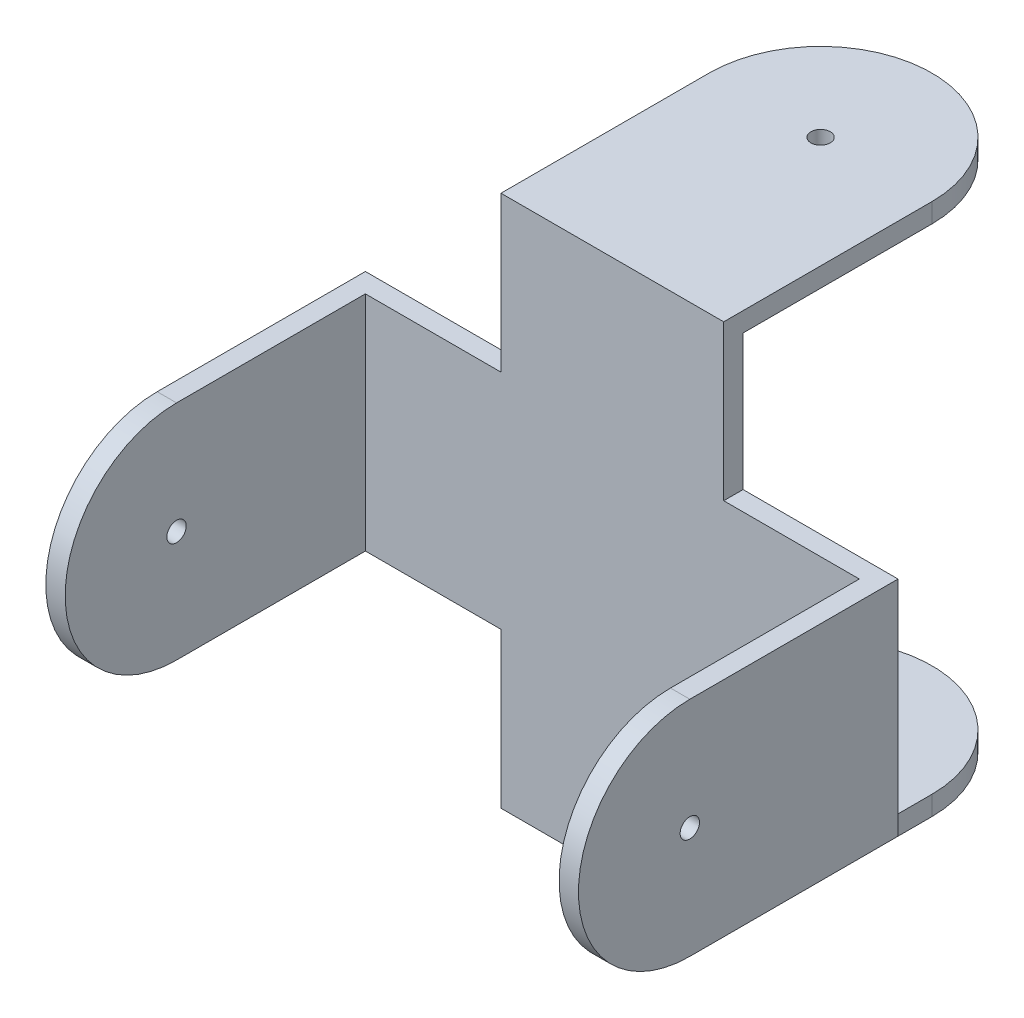
ISO-10303-21;
HEADER;
FILE_DESCRIPTION(('STEP AP214'),'2;1');
FILE_NAME('part.step','',(''),(''),'','','');
FILE_SCHEMA(('AUTOMOTIVE_DESIGN { 1 0 10303 214 1 1 1 1 }'));
ENDSEC;
DATA;
#1=APPLICATION_CONTEXT('core data for automotive mechanical design processes');
#2=APPLICATION_PROTOCOL_DEFINITION('international standard','automotive_design',2000,#1);
#3=PRODUCT_CONTEXT('',#1,'mechanical');
#4=PRODUCT('Part','Part','',(#3));
#5=PRODUCT_RELATED_PRODUCT_CATEGORY('part','',(#4));
#6=PRODUCT_DEFINITION_FORMATION('','',#4);
#7=PRODUCT_DEFINITION_CONTEXT('part definition',#1,'design');
#8=PRODUCT_DEFINITION('design','',#6,#7);
#9=PRODUCT_DEFINITION_SHAPE('','',#8);
#10=(LENGTH_UNIT() NAMED_UNIT(*) SI_UNIT(.MILLI.,.METRE.));
#11=(NAMED_UNIT(*) PLANE_ANGLE_UNIT() SI_UNIT($,.RADIAN.));
#12=(NAMED_UNIT(*) SI_UNIT($,.STERADIAN.) SOLID_ANGLE_UNIT());
#13=UNCERTAINTY_MEASURE_WITH_UNIT(LENGTH_MEASURE(1.E-05),#10,'distance_accuracy_value','');
#14=(GEOMETRIC_REPRESENTATION_CONTEXT(3) GLOBAL_UNCERTAINTY_ASSIGNED_CONTEXT((#13)) GLOBAL_UNIT_ASSIGNED_CONTEXT((#10,
#11,#12)) REPRESENTATION_CONTEXT('',''));
#15=CARTESIAN_POINT('',(0.,0.,0.));
#16=DIRECTION('',(0.,0.,1.));
#17=DIRECTION('',(1.,0.,0.));
#18=AXIS2_PLACEMENT_3D('',#15,#16,#17);
#19=CARTESIAN_POINT('',(0.,0.,2.));
#20=DIRECTION('',(0.,0.,-1.));
#21=DIRECTION('',(-1.,0.,0.));
#22=AXIS2_PLACEMENT_3D('',#19,#20,#21);
#23=PLANE('',#22);
#24=DIRECTION('',(0.,-1.,0.));
#25=VECTOR('',#24,1.);
#26=CARTESIAN_POINT('',(25.5000000000002,0.,2.));
#27=LINE('',#26,#25);
#28=CARTESIAN_POINT('',(25.5000000000002,11.5000000000001,2.));
#29=VERTEX_POINT('',#28);
#30=CARTESIAN_POINT('',(25.5000000000002,-11.5,2.));
#31=VERTEX_POINT('',#30);
#32=EDGE_CURVE('E59',#29,#31,#27,.T.);
#33=ORIENTED_EDGE('',*,*,#32,.F.);
#34=DIRECTION('',(-1.,0.,0.));
#35=VECTOR('',#34,1.);
#36=CARTESIAN_POINT('',(27.5000000000002,11.5000000000001,2.));
#37=LINE('',#36,#35);
#38=CARTESIAN_POINT('',(11.5,11.5,2.));
#39=VERTEX_POINT('',#38);
#40=EDGE_CURVE('E200',#29,#39,#37,.T.);
#41=ORIENTED_EDGE('',*,*,#40,.T.);
#42=DIRECTION('',(0.,1.,0.));
#43=VECTOR('',#42,1.);
#44=CARTESIAN_POINT('',(11.5,11.5,2.));
#45=LINE('',#44,#43);
#46=CARTESIAN_POINT('',(11.5,27.5,2.));
#47=VERTEX_POINT('',#46);
#48=EDGE_CURVE('E312',#39,#47,#45,.T.);
#49=ORIENTED_EDGE('',*,*,#48,.T.);
#50=DIRECTION('',(-1.,0.,0.));
#51=VECTOR('',#50,1.);
#52=CARTESIAN_POINT('',(-11.5,27.5,2.));
#53=LINE('',#52,#51);
#54=CARTESIAN_POINT('',(-11.5,27.5,2.));
#55=VERTEX_POINT('',#54);
#56=EDGE_CURVE('E315',#47,#55,#53,.T.);
#57=ORIENTED_EDGE('',*,*,#56,.T.);
#58=DIRECTION('',(0.,-1.,0.));
#59=VECTOR('',#58,1.);
#60=CARTESIAN_POINT('',(-11.5,11.5,2.));
#61=LINE('',#60,#59);
#62=CARTESIAN_POINT('',(-11.5,11.5,2.));
#63=VERTEX_POINT('',#62);
#64=EDGE_CURVE('E319',#55,#63,#61,.T.);
#65=ORIENTED_EDGE('',*,*,#64,.T.);
#66=DIRECTION('',(-1.,0.,0.));
#67=VECTOR('',#66,1.);
#68=CARTESIAN_POINT('',(-11.5,11.5,2.));
#69=LINE('',#68,#67);
#70=CARTESIAN_POINT('',(-25.5000000000002,11.5,2.));
#71=VERTEX_POINT('',#70);
#72=EDGE_CURVE('E322',#63,#71,#69,.T.);
#73=ORIENTED_EDGE('',*,*,#72,.T.);
#74=DIRECTION('',(0.,1.,0.));
#75=VECTOR('',#74,1.);
#76=CARTESIAN_POINT('',(-25.5000000000002,0.,2.));
#77=LINE('',#76,#75);
#78=CARTESIAN_POINT('',(-25.5000000000002,-11.5000000000001,2.));
#79=VERTEX_POINT('',#78);
#80=EDGE_CURVE('E11',#79,#71,#77,.T.);
#81=ORIENTED_EDGE('',*,*,#80,.F.);
#82=DIRECTION('',(1.,0.,0.));
#83=VECTOR('',#82,1.);
#84=CARTESIAN_POINT('',(-11.5,-11.5,2.));
#85=LINE('',#84,#83);
#86=CARTESIAN_POINT('',(-11.5,-11.5,2.));
#87=VERTEX_POINT('',#86);
#88=EDGE_CURVE('E325',#79,#87,#85,.T.);
#89=ORIENTED_EDGE('',*,*,#88,.T.);
#90=DIRECTION('',(0.,-1.,0.));
#91=VECTOR('',#90,1.);
#92=CARTESIAN_POINT('',(-11.5,-27.5,2.));
#93=LINE('',#92,#91);
#94=CARTESIAN_POINT('',(-11.5,-27.5,2.));
#95=VERTEX_POINT('',#94);
#96=EDGE_CURVE('E328',#87,#95,#93,.T.);
#97=ORIENTED_EDGE('',*,*,#96,.T.);
#98=DIRECTION('',(1.,0.,0.));
#99=VECTOR('',#98,1.);
#100=CARTESIAN_POINT('',(-11.5,-27.5,2.));
#101=LINE('',#100,#99);
#102=CARTESIAN_POINT('',(11.5,-27.5,2.));
#103=VERTEX_POINT('',#102);
#104=EDGE_CURVE('E331',#95,#103,#101,.T.);
#105=ORIENTED_EDGE('',*,*,#104,.T.);
#106=DIRECTION('',(0.,1.,0.));
#107=VECTOR('',#106,1.);
#108=CARTESIAN_POINT('',(11.5,-27.5,2.));
#109=LINE('',#108,#107);
#110=CARTESIAN_POINT('',(11.5,-11.5,2.));
#111=VERTEX_POINT('',#110);
#112=EDGE_CURVE('E334',#103,#111,#109,.T.);
#113=ORIENTED_EDGE('',*,*,#112,.T.);
#114=DIRECTION('',(1.,0.,0.));
#115=VECTOR('',#114,1.);
#116=CARTESIAN_POINT('',(27.5000000000002,-11.5000000000001,2.));
#117=LINE('',#116,#115);
#118=EDGE_CURVE('E55',#111,#31,#117,.T.);
#119=ORIENTED_EDGE('',*,*,#118,.T.);
#120=EDGE_LOOP('',(#33,#41,#49,#57,#65,#73,#81,#89,#97,#105,#113,#119));
#121=FACE_BOUND('',#120,.T.);
#122=ADVANCED_FACE('F39',(#121),#23,.F.);
#123=CARTESIAN_POINT('',(0.,0.,0.));
#124=DIRECTION('',(0.,0.,-1.));
#125=DIRECTION('',(-1.,0.,0.));
#126=AXIS2_PLACEMENT_3D('',#123,#124,#125);
#127=PLANE('',#126);
#128=DIRECTION('',(0.,1.,0.));
#129=VECTOR('',#128,1.);
#130=CARTESIAN_POINT('',(27.5000000000002,-11.5000000000001,0.));
#131=LINE('',#130,#129);
#132=CARTESIAN_POINT('',(27.5000000000002,-11.5000000000001,0.));
#133=VERTEX_POINT('',#132);
#134=CARTESIAN_POINT('',(27.5000000000002,11.5000000000001,0.));
#135=VERTEX_POINT('',#134);
#136=EDGE_CURVE('E367',#133,#135,#131,.T.);
#137=ORIENTED_EDGE('',*,*,#136,.F.);
#138=DIRECTION('',(1.,0.,0.));
#139=VECTOR('',#138,1.);
#140=CARTESIAN_POINT('',(27.5000000000002,-11.5000000000001,0.));
#141=LINE('',#140,#139);
#142=CARTESIAN_POINT('',(11.5,-11.5,0.));
#143=VERTEX_POINT('',#142);
#144=EDGE_CURVE('E364',#143,#133,#141,.T.);
#145=ORIENTED_EDGE('',*,*,#144,.F.);
#146=DIRECTION('',(0.,1.,0.));
#147=VECTOR('',#146,1.);
#148=CARTESIAN_POINT('',(11.5,-27.5,0.));
#149=LINE('',#148,#147);
#150=CARTESIAN_POINT('',(11.5,-25.5,0.));
#151=VERTEX_POINT('',#150);
#152=EDGE_CURVE('E361',#151,#143,#149,.T.);
#153=ORIENTED_EDGE('',*,*,#152,.F.);
#154=DIRECTION('',(-1.,0.,0.));
#155=VECTOR('',#154,1.);
#156=CARTESIAN_POINT('',(0.,-25.5,0.));
#157=LINE('',#156,#155);
#158=CARTESIAN_POINT('',(-11.5,-25.5,0.));
#159=VERTEX_POINT('',#158);
#160=EDGE_CURVE('E273',#151,#159,#157,.T.);
#161=ORIENTED_EDGE('',*,*,#160,.T.);
#162=DIRECTION('',(0.,-1.,0.));
#163=VECTOR('',#162,1.);
#164=CARTESIAN_POINT('',(-11.5,-27.5,0.));
#165=LINE('',#164,#163);
#166=CARTESIAN_POINT('',(-11.5,-11.5,0.));
#167=VERTEX_POINT('',#166);
#168=EDGE_CURVE('E357',#167,#159,#165,.T.);
#169=ORIENTED_EDGE('',*,*,#168,.F.);
#170=DIRECTION('',(1.,0.,0.));
#171=VECTOR('',#170,1.);
#172=CARTESIAN_POINT('',(-11.5,-11.5,0.));
#173=LINE('',#172,#171);
#174=CARTESIAN_POINT('',(-27.5000000000002,-11.5000000000001,0.));
#175=VERTEX_POINT('',#174);
#176=EDGE_CURVE('E354',#175,#167,#173,.T.);
#177=ORIENTED_EDGE('',*,*,#176,.F.);
#178=DIRECTION('',(0.,-1.,0.));
#179=VECTOR('',#178,1.);
#180=CARTESIAN_POINT('',(-27.5000000000002,-11.5000000000001,0.));
#181=LINE('',#180,#179);
#182=CARTESIAN_POINT('',(-27.5000000000002,11.5,0.));
#183=VERTEX_POINT('',#182);
#184=EDGE_CURVE('E351',#183,#175,#181,.T.);
#185=ORIENTED_EDGE('',*,*,#184,.F.);
#186=DIRECTION('',(-1.,0.,0.));
#187=VECTOR('',#186,1.);
#188=CARTESIAN_POINT('',(-11.5,11.5,0.));
#189=LINE('',#188,#187);
#190=CARTESIAN_POINT('',(-11.5,11.5,0.));
#191=VERTEX_POINT('',#190);
#192=EDGE_CURVE('E348',#191,#183,#189,.T.);
#193=ORIENTED_EDGE('',*,*,#192,.F.);
#194=DIRECTION('',(0.,-1.,0.));
#195=VECTOR('',#194,1.);
#196=CARTESIAN_POINT('',(-11.5,11.5,0.));
#197=LINE('',#196,#195);
#198=CARTESIAN_POINT('',(-11.5,25.5,0.));
#199=VERTEX_POINT('',#198);
#200=EDGE_CURVE('E345',#199,#191,#197,.T.);
#201=ORIENTED_EDGE('',*,*,#200,.F.);
#202=DIRECTION('',(1.,0.,0.));
#203=VECTOR('',#202,1.);
#204=CARTESIAN_POINT('',(0.,25.5,0.));
#205=LINE('',#204,#203);
#206=CARTESIAN_POINT('',(11.5,25.5,0.));
#207=VERTEX_POINT('',#206);
#208=EDGE_CURVE('E48',#199,#207,#205,.T.);
#209=ORIENTED_EDGE('',*,*,#208,.T.);
#210=DIRECTION('',(0.,1.,0.));
#211=VECTOR('',#210,1.);
#212=CARTESIAN_POINT('',(11.5,11.5,0.));
#213=LINE('',#212,#211);
#214=CARTESIAN_POINT('',(11.5,11.5,0.));
#215=VERTEX_POINT('',#214);
#216=EDGE_CURVE('E308',#215,#207,#213,.T.);
#217=ORIENTED_EDGE('',*,*,#216,.F.);
#218=DIRECTION('',(-1.,0.,0.));
#219=VECTOR('',#218,1.);
#220=CARTESIAN_POINT('',(27.5000000000002,11.5000000000001,0.));
#221=LINE('',#220,#219);
#222=EDGE_CURVE('E316',#135,#215,#221,.T.);
#223=ORIENTED_EDGE('',*,*,#222,.F.);
#224=EDGE_LOOP('',(#137,#145,#153,#161,#169,#177,#185,#193,#201,#209,#217,#223));
#225=FACE_BOUND('',#224,.T.);
#226=ADVANCED_FACE('F419',(#225),#127,.T.);
#227=CARTESIAN_POINT('',(11.5,11.5,2.));
#228=DIRECTION('',(-1.,0.,0.));
#229=DIRECTION('',(0.,0.,1.));
#230=AXIS2_PLACEMENT_3D('',#227,#228,#229);
#231=PLANE('',#230);
#232=DIRECTION('',(0.,0.,-1.));
#233=VECTOR('',#232,1.);
#234=CARTESIAN_POINT('',(11.5,27.5,2.));
#235=LINE('',#234,#233);
#236=CARTESIAN_POINT('',(11.5,27.5,-19.5));
#237=VERTEX_POINT('',#236);
#238=EDGE_CURVE('E411',#47,#237,#235,.T.);
#239=ORIENTED_EDGE('',*,*,#238,.F.);
#240=ORIENTED_EDGE('',*,*,#48,.F.);
#241=DIRECTION('',(0.,0.,-1.));
#242=VECTOR('',#241,1.);
#243=CARTESIAN_POINT('',(11.5,11.5,2.));
#244=LINE('',#243,#242);
#245=EDGE_CURVE('E341',#39,#215,#244,.T.);
#246=ORIENTED_EDGE('',*,*,#245,.T.);
#247=ORIENTED_EDGE('',*,*,#216,.T.);
#248=DIRECTION('',(0.,0.,-1.));
#249=VECTOR('',#248,1.);
#250=CARTESIAN_POINT('',(11.5,25.5,2.));
#251=LINE('',#250,#249);
#252=CARTESIAN_POINT('',(11.5,25.5,-19.5));
#253=VERTEX_POINT('',#252);
#254=EDGE_CURVE('E293',#207,#253,#251,.T.);
#255=ORIENTED_EDGE('',*,*,#254,.T.);
#256=DIRECTION('',(0.,1.,0.));
#257=VECTOR('',#256,1.);
#258=CARTESIAN_POINT('',(11.5,25.5,-19.5));
#259=LINE('',#258,#257);
#260=EDGE_CURVE('E300',#253,#237,#259,.T.);
#261=ORIENTED_EDGE('',*,*,#260,.T.);
#262=EDGE_LOOP('',(#239,#240,#246,#247,#255,#261));
#263=FACE_BOUND('',#262,.T.);
#264=ADVANCED_FACE('F41',(#263),#231,.F.);
#265=CARTESIAN_POINT('',(-11.5,27.5,2.));
#266=DIRECTION('',(0.,-1.,0.));
#267=DIRECTION('',(0.,0.,-1.));
#268=AXIS2_PLACEMENT_3D('',#265,#266,#267);
#269=PLANE('',#268);
#270=CARTESIAN_POINT('',(0.,27.5,-19.5));
#271=DIRECTION('',(0.,1.,0.));
#272=DIRECTION('',(0.,0.,1.));
#273=AXIS2_PLACEMENT_3D('',#270,#271,#272);
#274=CIRCLE('',#273,1.);
#275=CARTESIAN_POINT('',(0.,27.5,-18.5));
#276=VERTEX_POINT('',#275);
#277=EDGE_CURVE('E280',#276,#276,#274,.T.);
#278=ORIENTED_EDGE('',*,*,#277,.F.);
#279=EDGE_LOOP('',(#278));
#280=FACE_BOUND('',#279,.T.);
#281=ORIENTED_EDGE('',*,*,#238,.T.);
#282=CARTESIAN_POINT('',(0.,27.5,-19.5));
#283=DIRECTION('',(0.,1.,0.));
#284=DIRECTION('',(0.,0.,1.));
#285=AXIS2_PLACEMENT_3D('',#282,#283,#284);
#286=CIRCLE('',#285,11.5);
#287=CARTESIAN_POINT('',(-11.5,27.5,-19.5));
#288=VERTEX_POINT('',#287);
#289=EDGE_CURVE('E288',#237,#288,#286,.T.);
#290=ORIENTED_EDGE('',*,*,#289,.T.);
#291=DIRECTION('',(0.,0.,-1.));
#292=VECTOR('',#291,1.);
#293=CARTESIAN_POINT('',(-11.5,27.5,2.));
#294=LINE('',#293,#292);
#295=EDGE_CURVE('E408',#55,#288,#294,.T.);
#296=ORIENTED_EDGE('',*,*,#295,.F.);
#297=ORIENTED_EDGE('',*,*,#56,.F.);
#298=EDGE_LOOP('',(#281,#290,#296,#297));
#299=FACE_BOUND('',#298,.T.);
#300=ADVANCED_FACE('F479',(#280,#299),#269,.F.);
#301=CARTESIAN_POINT('',(-11.5,11.5,2.));
#302=DIRECTION('',(1.,0.,0.));
#303=DIRECTION('',(0.,1.,0.));
#304=AXIS2_PLACEMENT_3D('',#301,#302,#303);
#305=PLANE('',#304);
#306=ORIENTED_EDGE('',*,*,#295,.T.);
#307=DIRECTION('',(0.,1.,0.));
#308=VECTOR('',#307,1.);
#309=CARTESIAN_POINT('',(-11.5,25.5,-19.5));
#310=LINE('',#309,#308);
#311=CARTESIAN_POINT('',(-11.5,25.5,-19.5));
#312=VERTEX_POINT('',#311);
#313=EDGE_CURVE('E304',#312,#288,#310,.T.);
#314=ORIENTED_EDGE('',*,*,#313,.F.);
#315=DIRECTION('',(0.,0.,1.));
#316=VECTOR('',#315,1.);
#317=CARTESIAN_POINT('',(-11.5,25.5,2.));
#318=LINE('',#317,#316);
#319=EDGE_CURVE('E289',#312,#199,#318,.T.);
#320=ORIENTED_EDGE('',*,*,#319,.T.);
#321=ORIENTED_EDGE('',*,*,#200,.T.);
#322=DIRECTION('',(0.,0.,-1.));
#323=VECTOR('',#322,1.);
#324=CARTESIAN_POINT('',(-11.5,11.5,2.));
#325=LINE('',#324,#323);
#326=EDGE_CURVE('E404',#63,#191,#325,.T.);
#327=ORIENTED_EDGE('',*,*,#326,.F.);
#328=ORIENTED_EDGE('',*,*,#64,.F.);
#329=EDGE_LOOP('',(#306,#314,#320,#321,#327,#328));
#330=FACE_BOUND('',#329,.T.);
#331=ADVANCED_FACE('F472',(#330),#305,.F.);
#332=CARTESIAN_POINT('',(-11.5,11.5,2.));
#333=DIRECTION('',(0.,-1.,0.));
#334=DIRECTION('',(1.,0.,0.));
#335=AXIS2_PLACEMENT_3D('',#332,#333,#334);
#336=PLANE('',#335);
#337=DIRECTION('',(0.,0.,-1.));
#338=VECTOR('',#337,1.);
#339=CARTESIAN_POINT('',(-27.5000000000002,11.5,2.));
#340=LINE('',#339,#338);
#341=CARTESIAN_POINT('',(-27.5000000000002,11.5,21.5));
#342=VERTEX_POINT('',#341);
#343=EDGE_CURVE('E400',#342,#183,#340,.T.);
#344=ORIENTED_EDGE('',*,*,#343,.F.);
#345=DIRECTION('',(-1.,0.,0.));
#346=VECTOR('',#345,1.);
#347=CARTESIAN_POINT('',(-25.5000000000002,11.5,21.5));
#348=LINE('',#347,#346);
#349=CARTESIAN_POINT('',(-25.5000000000002,11.5,21.5));
#350=VERTEX_POINT('',#349);
#351=EDGE_CURVE('E240',#350,#342,#348,.T.);
#352=ORIENTED_EDGE('',*,*,#351,.F.);
#353=DIRECTION('',(0.,0.,-1.));
#354=VECTOR('',#353,1.);
#355=CARTESIAN_POINT('',(-25.5000000000002,11.5,0.));
#356=LINE('',#355,#354);
#357=EDGE_CURVE('E232',#350,#71,#356,.T.);
#358=ORIENTED_EDGE('',*,*,#357,.T.);
#359=ORIENTED_EDGE('',*,*,#72,.F.);
#360=ORIENTED_EDGE('',*,*,#326,.T.);
#361=ORIENTED_EDGE('',*,*,#192,.T.);
#362=EDGE_LOOP('',(#344,#352,#358,#359,#360,#361));
#363=FACE_BOUND('',#362,.T.);
#364=ADVANCED_FACE('F458',(#363),#336,.F.);
#365=CARTESIAN_POINT('',(-27.5000000000002,-11.5000000000001,2.));
#366=DIRECTION('',(1.,0.,0.));
#367=DIRECTION('',(0.,1.,0.));
#368=AXIS2_PLACEMENT_3D('',#365,#366,#367);
#369=PLANE('',#368);
#370=CARTESIAN_POINT('',(-27.5000000000002,0.,21.5));
#371=DIRECTION('',(-1.,0.,0.));
#372=DIRECTION('',(0.,-1.,0.));
#373=AXIS2_PLACEMENT_3D('',#370,#371,#372);
#374=CIRCLE('',#373,1.);
#375=CARTESIAN_POINT('',(-27.5000000000002,-1.00000000000003,21.5));
#376=VERTEX_POINT('',#375);
#377=EDGE_CURVE('E216',#376,#376,#374,.T.);
#378=ORIENTED_EDGE('',*,*,#377,.F.);
#379=EDGE_LOOP('',(#378));
#380=FACE_BOUND('',#379,.T.);
#381=ORIENTED_EDGE('',*,*,#184,.T.);
#382=DIRECTION('',(0.,0.,-1.));
#383=VECTOR('',#382,1.);
#384=CARTESIAN_POINT('',(-27.5000000000002,-11.5000000000001,2.));
#385=LINE('',#384,#383);
#386=CARTESIAN_POINT('',(-27.5000000000002,-11.5,21.5));
#387=VERTEX_POINT('',#386);
#388=EDGE_CURVE('E396',#387,#175,#385,.T.);
#389=ORIENTED_EDGE('',*,*,#388,.F.);
#390=CARTESIAN_POINT('',(-27.5000000000002,0.,21.5));
#391=DIRECTION('',(-1.,0.,0.));
#392=DIRECTION('',(0.,-1.,0.));
#393=AXIS2_PLACEMENT_3D('',#390,#391,#392);
#394=CIRCLE('',#393,11.5);
#395=EDGE_CURVE('E224',#387,#342,#394,.T.);
#396=ORIENTED_EDGE('',*,*,#395,.T.);
#397=ORIENTED_EDGE('',*,*,#343,.T.);
#398=EDGE_LOOP('',(#381,#389,#396,#397));
#399=FACE_BOUND('',#398,.T.);
#400=ADVANCED_FACE('F455',(#380,#399),#369,.F.);
#401=CARTESIAN_POINT('',(-11.5,-11.5,2.));
#402=DIRECTION('',(0.,1.,0.));
#403=DIRECTION('',(-1.,0.,0.));
#404=AXIS2_PLACEMENT_3D('',#401,#402,#403);
#405=PLANE('',#404);
#406=ORIENTED_EDGE('',*,*,#176,.T.);
#407=DIRECTION('',(0.,0.,-1.));
#408=VECTOR('',#407,1.);
#409=CARTESIAN_POINT('',(-11.5,-11.5,2.));
#410=LINE('',#409,#408);
#411=EDGE_CURVE('E392',#87,#167,#410,.T.);
#412=ORIENTED_EDGE('',*,*,#411,.F.);
#413=ORIENTED_EDGE('',*,*,#88,.F.);
#414=DIRECTION('',(0.,0.,1.));
#415=VECTOR('',#414,1.);
#416=CARTESIAN_POINT('',(-25.5000000000002,-11.5,0.));
#417=LINE('',#416,#415);
#418=CARTESIAN_POINT('',(-25.5000000000002,-11.5,21.5));
#419=VERTEX_POINT('',#418);
#420=EDGE_CURVE('E225',#79,#419,#417,.T.);
#421=ORIENTED_EDGE('',*,*,#420,.T.);
#422=DIRECTION('',(-1.,0.,0.));
#423=VECTOR('',#422,1.);
#424=CARTESIAN_POINT('',(-25.5000000000002,-11.5,21.5));
#425=LINE('',#424,#423);
#426=EDGE_CURVE('E236',#419,#387,#425,.T.);
#427=ORIENTED_EDGE('',*,*,#426,.T.);
#428=ORIENTED_EDGE('',*,*,#388,.T.);
#429=EDGE_LOOP('',(#406,#412,#413,#421,#427,#428));
#430=FACE_BOUND('',#429,.T.);
#431=ADVANCED_FACE('F451',(#430),#405,.F.);
#432=CARTESIAN_POINT('',(-11.5,-27.5,2.));
#433=DIRECTION('',(1.,0.,0.));
#434=DIRECTION('',(0.,0.,-1.));
#435=AXIS2_PLACEMENT_3D('',#432,#433,#434);
#436=PLANE('',#435);
#437=DIRECTION('',(0.,0.,-1.));
#438=VECTOR('',#437,1.);
#439=CARTESIAN_POINT('',(-11.5,-27.5,2.));
#440=LINE('',#439,#438);
#441=CARTESIAN_POINT('',(-11.5,-27.5,-19.5));
#442=VERTEX_POINT('',#441);
#443=EDGE_CURVE('E389',#95,#442,#440,.T.);
#444=ORIENTED_EDGE('',*,*,#443,.F.);
#445=ORIENTED_EDGE('',*,*,#96,.F.);
#446=ORIENTED_EDGE('',*,*,#411,.T.);
#447=ORIENTED_EDGE('',*,*,#168,.T.);
#448=DIRECTION('',(0.,0.,1.));
#449=VECTOR('',#448,1.);
#450=CARTESIAN_POINT('',(-11.5,-25.5,2.));
#451=LINE('',#450,#449);
#452=CARTESIAN_POINT('',(-11.5,-25.5,-19.5));
#453=VERTEX_POINT('',#452);
#454=EDGE_CURVE('E256',#453,#159,#451,.T.);
#455=ORIENTED_EDGE('',*,*,#454,.F.);
#456=DIRECTION('',(0.,-1.,0.));
#457=VECTOR('',#456,1.);
#458=CARTESIAN_POINT('',(-11.5,-25.5,-19.5));
#459=LINE('',#458,#457);
#460=EDGE_CURVE('E265',#453,#442,#459,.T.);
#461=ORIENTED_EDGE('',*,*,#460,.T.);
#462=EDGE_LOOP('',(#444,#445,#446,#447,#455,#461));
#463=FACE_BOUND('',#462,.T.);
#464=ADVANCED_FACE('F446',(#463),#436,.F.);
#465=CARTESIAN_POINT('',(-11.5,-27.5,2.));
#466=DIRECTION('',(0.,1.,0.));
#467=DIRECTION('',(0.,0.,1.));
#468=AXIS2_PLACEMENT_3D('',#465,#466,#467);
#469=PLANE('',#468);
#470=CARTESIAN_POINT('',(0.,-27.5,-19.5));
#471=DIRECTION('',(0.,1.,0.));
#472=DIRECTION('',(0.,0.,1.));
#473=AXIS2_PLACEMENT_3D('',#470,#471,#472);
#474=CIRCLE('',#473,1.);
#475=CARTESIAN_POINT('',(0.,-27.5,-18.5));
#476=VERTEX_POINT('',#475);
#477=EDGE_CURVE('E248',#476,#476,#474,.T.);
#478=ORIENTED_EDGE('',*,*,#477,.T.);
#479=EDGE_LOOP('',(#478));
#480=FACE_BOUND('',#479,.T.);
#481=ORIENTED_EDGE('',*,*,#443,.T.);
#482=CARTESIAN_POINT('',(0.,-27.5,-19.5));
#483=DIRECTION('',(0.,1.,0.));
#484=DIRECTION('',(0.,0.,1.));
#485=AXIS2_PLACEMENT_3D('',#482,#483,#484);
#486=CIRCLE('',#485,11.5);
#487=CARTESIAN_POINT('',(11.5,-27.5,-19.5));
#488=VERTEX_POINT('',#487);
#489=EDGE_CURVE('E252',#488,#442,#486,.T.);
#490=ORIENTED_EDGE('',*,*,#489,.F.);
#491=DIRECTION('',(0.,0.,-1.));
#492=VECTOR('',#491,1.);
#493=CARTESIAN_POINT('',(11.5,-27.5,2.));
#494=LINE('',#493,#492);
#495=EDGE_CURVE('E386',#103,#488,#494,.T.);
#496=ORIENTED_EDGE('',*,*,#495,.F.);
#497=ORIENTED_EDGE('',*,*,#104,.F.);
#498=EDGE_LOOP('',(#481,#490,#496,#497));
#499=FACE_BOUND('',#498,.T.);
#500=ADVANCED_FACE('F506',(#480,#499),#469,.F.);
#501=CARTESIAN_POINT('',(11.5,-27.5,2.));
#502=DIRECTION('',(-1.,0.,0.));
#503=DIRECTION('',(0.,-1.,0.));
#504=AXIS2_PLACEMENT_3D('',#501,#502,#503);
#505=PLANE('',#504);
#506=ORIENTED_EDGE('',*,*,#495,.T.);
#507=DIRECTION('',(0.,-1.,0.));
#508=VECTOR('',#507,1.);
#509=CARTESIAN_POINT('',(11.5,-25.5,-19.5));
#510=LINE('',#509,#508);
#511=CARTESIAN_POINT('',(11.5,-25.5,-19.5));
#512=VERTEX_POINT('',#511);
#513=EDGE_CURVE('E269',#512,#488,#510,.T.);
#514=ORIENTED_EDGE('',*,*,#513,.F.);
#515=DIRECTION('',(0.,0.,-1.));
#516=VECTOR('',#515,1.);
#517=CARTESIAN_POINT('',(11.5,-25.5,2.));
#518=LINE('',#517,#516);
#519=EDGE_CURVE('E262',#151,#512,#518,.T.);
#520=ORIENTED_EDGE('',*,*,#519,.F.);
#521=ORIENTED_EDGE('',*,*,#152,.T.);
#522=DIRECTION('',(0.,0.,-1.));
#523=VECTOR('',#522,1.);
#524=CARTESIAN_POINT('',(11.5,-11.5,2.));
#525=LINE('',#524,#523);
#526=EDGE_CURVE('E382',#111,#143,#525,.T.);
#527=ORIENTED_EDGE('',*,*,#526,.F.);
#528=ORIENTED_EDGE('',*,*,#112,.F.);
#529=EDGE_LOOP('',(#506,#514,#520,#521,#527,#528));
#530=FACE_BOUND('',#529,.T.);
#531=ADVANCED_FACE('F437',(#530),#505,.F.);
#532=CARTESIAN_POINT('',(27.5000000000002,-11.5000000000001,2.));
#533=DIRECTION('',(0.,1.,0.));
#534=DIRECTION('',(-1.,0.,0.));
#535=AXIS2_PLACEMENT_3D('',#532,#533,#534);
#536=PLANE('',#535);
#537=DIRECTION('',(0.,0.,-1.));
#538=VECTOR('',#537,1.);
#539=CARTESIAN_POINT('',(27.5000000000002,-11.5000000000001,2.));
#540=LINE('',#539,#538);
#541=CARTESIAN_POINT('',(27.5000000000002,-11.5,21.5));
#542=VERTEX_POINT('',#541);
#543=EDGE_CURVE('E378',#542,#133,#540,.T.);
#544=ORIENTED_EDGE('',*,*,#543,.F.);
#545=DIRECTION('',(1.,0.,0.));
#546=VECTOR('',#545,1.);
#547=CARTESIAN_POINT('',(25.5000000000002,-11.5,21.5));
#548=LINE('',#547,#546);
#549=CARTESIAN_POINT('',(25.5000000000002,-11.5,21.5));
#550=VERTEX_POINT('',#549);
#551=EDGE_CURVE('E196',#550,#542,#548,.T.);
#552=ORIENTED_EDGE('',*,*,#551,.F.);
#553=DIRECTION('',(0.,0.,1.));
#554=VECTOR('',#553,1.);
#555=CARTESIAN_POINT('',(25.5000000000002,-11.5,0.));
#556=LINE('',#555,#554);
#557=EDGE_CURVE('E181',#31,#550,#556,.T.);
#558=ORIENTED_EDGE('',*,*,#557,.F.);
#559=ORIENTED_EDGE('',*,*,#118,.F.);
#560=ORIENTED_EDGE('',*,*,#526,.T.);
#561=ORIENTED_EDGE('',*,*,#144,.T.);
#562=EDGE_LOOP('',(#544,#552,#558,#559,#560,#561));
#563=FACE_BOUND('',#562,.T.);
#564=ADVANCED_FACE('F433',(#563),#536,.F.);
#565=CARTESIAN_POINT('',(27.5000000000002,-11.5000000000001,2.));
#566=DIRECTION('',(-1.,0.,0.));
#567=DIRECTION('',(0.,-1.,0.));
#568=AXIS2_PLACEMENT_3D('',#565,#566,#567);
#569=PLANE('',#568);
#570=CARTESIAN_POINT('',(27.5000000000002,0.,21.5));
#571=DIRECTION('',(-1.,0.,0.));
#572=DIRECTION('',(0.,-1.,0.));
#573=AXIS2_PLACEMENT_3D('',#570,#571,#572);
#574=CIRCLE('',#573,1.);
#575=CARTESIAN_POINT('',(27.5000000000002,-1.00000000000003,21.5));
#576=VERTEX_POINT('',#575);
#577=EDGE_CURVE('E204',#576,#576,#574,.T.);
#578=ORIENTED_EDGE('',*,*,#577,.T.);
#579=EDGE_LOOP('',(#578));
#580=FACE_BOUND('',#579,.T.);
#581=ORIENTED_EDGE('',*,*,#136,.T.);
#582=DIRECTION('',(0.,0.,-1.));
#583=VECTOR('',#582,1.);
#584=CARTESIAN_POINT('',(27.5000000000002,11.5000000000001,2.));
#585=LINE('',#584,#583);
#586=CARTESIAN_POINT('',(27.5000000000002,11.5,21.5));
#587=VERTEX_POINT('',#586);
#588=EDGE_CURVE('E375',#587,#135,#585,.T.);
#589=ORIENTED_EDGE('',*,*,#588,.F.);
#590=CARTESIAN_POINT('',(27.5000000000002,0.,21.5));
#591=DIRECTION('',(-1.,0.,0.));
#592=DIRECTION('',(0.,-1.,0.));
#593=AXIS2_PLACEMENT_3D('',#590,#591,#592);
#594=CIRCLE('',#593,11.5);
#595=EDGE_CURVE('E192',#542,#587,#594,.T.);
#596=ORIENTED_EDGE('',*,*,#595,.F.);
#597=ORIENTED_EDGE('',*,*,#543,.T.);
#598=EDGE_LOOP('',(#581,#589,#596,#597));
#599=FACE_BOUND('',#598,.T.);
#600=ADVANCED_FACE('F431',(#580,#599),#569,.F.);
#601=CARTESIAN_POINT('',(27.5000000000002,11.5000000000001,2.));
#602=DIRECTION('',(0.,-1.,0.));
#603=DIRECTION('',(1.,0.,0.));
#604=AXIS2_PLACEMENT_3D('',#601,#602,#603);
#605=PLANE('',#604);
#606=ORIENTED_EDGE('',*,*,#222,.T.);
#607=ORIENTED_EDGE('',*,*,#245,.F.);
#608=ORIENTED_EDGE('',*,*,#40,.F.);
#609=DIRECTION('',(0.,0.,-1.));
#610=VECTOR('',#609,1.);
#611=CARTESIAN_POINT('',(25.5000000000002,11.5,0.));
#612=LINE('',#611,#610);
#613=CARTESIAN_POINT('',(25.5000000000002,11.5,21.5));
#614=VERTEX_POINT('',#613);
#615=EDGE_CURVE('E179',#614,#29,#612,.T.);
#616=ORIENTED_EDGE('',*,*,#615,.F.);
#617=DIRECTION('',(1.,0.,0.));
#618=VECTOR('',#617,1.);
#619=CARTESIAN_POINT('',(25.5000000000002,11.5,21.5));
#620=LINE('',#619,#618);
#621=EDGE_CURVE('E189',#614,#587,#620,.T.);
#622=ORIENTED_EDGE('',*,*,#621,.T.);
#623=ORIENTED_EDGE('',*,*,#588,.T.);
#624=EDGE_LOOP('',(#606,#607,#608,#616,#622,#623));
#625=FACE_BOUND('',#624,.T.);
#626=ADVANCED_FACE('F198',(#625),#605,.F.);
#627=CARTESIAN_POINT('',(0.,25.5,-19.5));
#628=DIRECTION('',(0.,1.,0.));
#629=DIRECTION('',(0.,0.,1.));
#630=AXIS2_PLACEMENT_3D('',#627,#628,#629);
#631=CYLINDRICAL_SURFACE('',#630,11.5);
#632=ORIENTED_EDGE('',*,*,#289,.F.);
#633=ORIENTED_EDGE('',*,*,#260,.F.);
#634=CARTESIAN_POINT('',(0.,25.5,-19.5));
#635=DIRECTION('',(0.,1.,0.));
#636=DIRECTION('',(0.,0.,1.));
#637=AXIS2_PLACEMENT_3D('',#634,#635,#636);
#638=CIRCLE('',#637,11.5);
#639=EDGE_CURVE('E296',#253,#312,#638,.T.);
#640=ORIENTED_EDGE('',*,*,#639,.T.);
#641=ORIENTED_EDGE('',*,*,#313,.T.);
#642=EDGE_LOOP('',(#632,#633,#640,#641));
#643=FACE_BOUND('',#642,.T.);
#644=ADVANCED_FACE('F477',(#643),#631,.T.);
#645=CARTESIAN_POINT('',(0.,25.5,-19.5));
#646=DIRECTION('',(0.,1.,0.));
#647=DIRECTION('',(0.,0.,1.));
#648=AXIS2_PLACEMENT_3D('',#645,#646,#647);
#649=PLANE('',#648);
#650=CARTESIAN_POINT('',(0.,25.5,-19.5));
#651=DIRECTION('',(0.,1.,0.));
#652=DIRECTION('',(0.,0.,1.));
#653=AXIS2_PLACEMENT_3D('',#650,#651,#652);
#654=CIRCLE('',#653,1.);
#655=CARTESIAN_POINT('',(0.,25.5,-18.5));
#656=VERTEX_POINT('',#655);
#657=EDGE_CURVE('E284',#656,#656,#654,.F.);
#658=ORIENTED_EDGE('',*,*,#657,.F.);
#659=EDGE_LOOP('',(#658));
#660=FACE_BOUND('',#659,.T.);
#661=ORIENTED_EDGE('',*,*,#208,.F.);
#662=ORIENTED_EDGE('',*,*,#319,.F.);
#663=ORIENTED_EDGE('',*,*,#639,.F.);
#664=ORIENTED_EDGE('',*,*,#254,.F.);
#665=EDGE_LOOP('',(#661,#662,#663,#664));
#666=FACE_BOUND('',#665,.T.);
#667=ADVANCED_FACE('F474',(#660,#666),#649,.F.);
#668=CARTESIAN_POINT('',(0.,-27.501,-19.5));
#669=DIRECTION('',(0.,1.,0.));
#670=DIRECTION('',(0.,0.,1.));
#671=AXIS2_PLACEMENT_3D('',#668,#669,#670);
#672=CYLINDRICAL_SURFACE('',#671,1.);
#673=ORIENTED_EDGE('',*,*,#277,.T.);
#674=EDGE_LOOP('',(#673));
#675=FACE_BOUND('',#674,.T.);
#676=ORIENTED_EDGE('',*,*,#657,.T.);
#677=EDGE_LOOP('',(#676));
#678=FACE_BOUND('',#677,.T.);
#679=ADVANCED_FACE('F572',(#675,#678),#672,.F.);
#680=CARTESIAN_POINT('',(0.,-25.5,-19.5));
#681=DIRECTION('',(0.,-1.,0.));
#682=DIRECTION('',(0.,0.,-1.));
#683=AXIS2_PLACEMENT_3D('',#680,#681,#682);
#684=CYLINDRICAL_SURFACE('',#683,11.5);
#685=ORIENTED_EDGE('',*,*,#489,.T.);
#686=ORIENTED_EDGE('',*,*,#460,.F.);
#687=CARTESIAN_POINT('',(0.,-25.5,-19.5));
#688=DIRECTION('',(0.,1.,0.));
#689=DIRECTION('',(0.,0.,1.));
#690=AXIS2_PLACEMENT_3D('',#687,#688,#689);
#691=CIRCLE('',#690,11.5);
#692=EDGE_CURVE('E259',#512,#453,#691,.T.);
#693=ORIENTED_EDGE('',*,*,#692,.F.);
#694=ORIENTED_EDGE('',*,*,#513,.T.);
#695=EDGE_LOOP('',(#685,#686,#693,#694));
#696=FACE_BOUND('',#695,.T.);
#697=ADVANCED_FACE('F578',(#696),#684,.T.);
#698=CARTESIAN_POINT('',(0.,-25.5,-19.5));
#699=DIRECTION('',(0.,-1.,0.));
#700=DIRECTION('',(0.,0.,1.));
#701=AXIS2_PLACEMENT_3D('',#698,#699,#700);
#702=PLANE('',#701);
#703=CARTESIAN_POINT('',(0.,-25.5,-19.5));
#704=DIRECTION('',(0.,-1.,0.));
#705=DIRECTION('',(0.,0.,-1.));
#706=AXIS2_PLACEMENT_3D('',#703,#704,#705);
#707=CIRCLE('',#706,1.);
#708=CARTESIAN_POINT('',(0.,-25.5,-20.5));
#709=VERTEX_POINT('',#708);
#710=EDGE_CURVE('E244',#709,#709,#707,.T.);
#711=ORIENTED_EDGE('',*,*,#710,.T.);
#712=EDGE_LOOP('',(#711));
#713=FACE_BOUND('',#712,.T.);
#714=ORIENTED_EDGE('',*,*,#160,.F.);
#715=ORIENTED_EDGE('',*,*,#519,.T.);
#716=ORIENTED_EDGE('',*,*,#692,.T.);
#717=ORIENTED_EDGE('',*,*,#454,.T.);
#718=EDGE_LOOP('',(#714,#715,#716,#717));
#719=FACE_BOUND('',#718,.T.);
#720=ADVANCED_FACE('F585',(#713,#719),#702,.F.);
#721=CARTESIAN_POINT('',(0.,27.501,-19.5));
#722=DIRECTION('',(0.,-1.,0.));
#723=DIRECTION('',(0.,0.,-1.));
#724=AXIS2_PLACEMENT_3D('',#721,#722,#723);
#725=CYLINDRICAL_SURFACE('',#724,1.);
#726=ORIENTED_EDGE('',*,*,#477,.F.);
#727=EDGE_LOOP('',(#726));
#728=FACE_BOUND('',#727,.T.);
#729=ORIENTED_EDGE('',*,*,#710,.F.);
#730=EDGE_LOOP('',(#729));
#731=FACE_BOUND('',#730,.T.);
#732=ADVANCED_FACE('F593',(#728,#731),#725,.F.);
#733=CARTESIAN_POINT('',(-25.5000000000002,0.,21.5));
#734=DIRECTION('',(-1.,0.,0.));
#735=DIRECTION('',(0.,-1.,0.));
#736=AXIS2_PLACEMENT_3D('',#733,#734,#735);
#737=PLANE('',#736);
#738=CARTESIAN_POINT('',(-25.5000000000002,0.,21.5));
#739=DIRECTION('',(-1.,0.,0.));
#740=DIRECTION('',(0.,-1.,0.));
#741=AXIS2_PLACEMENT_3D('',#738,#739,#740);
#742=CIRCLE('',#741,1.);
#743=CARTESIAN_POINT('',(-25.5000000000002,-1.00000000000002,21.5));
#744=VERTEX_POINT('',#743);
#745=EDGE_CURVE('E220',#744,#744,#742,.F.);
#746=ORIENTED_EDGE('',*,*,#745,.F.);
#747=EDGE_LOOP('',(#746));
#748=FACE_BOUND('',#747,.T.);
#749=ORIENTED_EDGE('',*,*,#420,.F.);
#750=ORIENTED_EDGE('',*,*,#80,.T.);
#751=ORIENTED_EDGE('',*,*,#357,.F.);
#752=CARTESIAN_POINT('',(-25.5000000000002,0.,21.5));
#753=DIRECTION('',(-1.,0.,0.));
#754=DIRECTION('',(0.,-1.,0.));
#755=AXIS2_PLACEMENT_3D('',#752,#753,#754);
#756=CIRCLE('',#755,11.5);
#757=EDGE_CURVE('E228',#419,#350,#756,.T.);
#758=ORIENTED_EDGE('',*,*,#757,.F.);
#759=EDGE_LOOP('',(#749,#750,#751,#758));
#760=FACE_BOUND('',#759,.T.);
#761=ADVANCED_FACE('F465',(#748,#760),#737,.F.);
#762=CARTESIAN_POINT('',(-25.5000000000002,0.,21.5));
#763=DIRECTION('',(-1.,0.,0.));
#764=DIRECTION('',(0.,-1.,0.));
#765=AXIS2_PLACEMENT_3D('',#762,#763,#764);
#766=CYLINDRICAL_SURFACE('',#765,11.5);
#767=ORIENTED_EDGE('',*,*,#395,.F.);
#768=ORIENTED_EDGE('',*,*,#426,.F.);
#769=ORIENTED_EDGE('',*,*,#757,.T.);
#770=ORIENTED_EDGE('',*,*,#351,.T.);
#771=EDGE_LOOP('',(#767,#768,#769,#770));
#772=FACE_BOUND('',#771,.T.);
#773=ADVANCED_FACE('F460',(#772),#766,.T.);
#774=CARTESIAN_POINT('',(27.5010000000002,0.,21.5));
#775=DIRECTION('',(-1.,0.,0.));
#776=DIRECTION('',(0.,-1.,0.));
#777=AXIS2_PLACEMENT_3D('',#774,#775,#776);
#778=CYLINDRICAL_SURFACE('',#777,1.);
#779=ORIENTED_EDGE('',*,*,#377,.T.);
#780=EDGE_LOOP('',(#779));
#781=FACE_BOUND('',#780,.T.);
#782=ORIENTED_EDGE('',*,*,#745,.T.);
#783=EDGE_LOOP('',(#782));
#784=FACE_BOUND('',#783,.T.);
#785=ADVANCED_FACE('F613',(#781,#784),#778,.F.);
#786=CARTESIAN_POINT('',(25.5000000000002,0.,21.5));
#787=DIRECTION('',(1.,0.,0.));
#788=DIRECTION('',(0.,-1.,0.));
#789=AXIS2_PLACEMENT_3D('',#786,#787,#788);
#790=PLANE('',#789);
#791=CARTESIAN_POINT('',(25.5000000000002,0.,21.5));
#792=DIRECTION('',(1.,0.,0.));
#793=DIRECTION('',(0.,1.,0.));
#794=AXIS2_PLACEMENT_3D('',#791,#792,#793);
#795=CIRCLE('',#794,1.);
#796=CARTESIAN_POINT('',(25.5000000000002,0.999999999999979,21.5));
#797=VERTEX_POINT('',#796);
#798=EDGE_CURVE('E207',#797,#797,#795,.T.);
#799=ORIENTED_EDGE('',*,*,#798,.T.);
#800=EDGE_LOOP('',(#799));
#801=FACE_BOUND('',#800,.T.);
#802=ORIENTED_EDGE('',*,*,#615,.T.);
#803=ORIENTED_EDGE('',*,*,#32,.T.);
#804=ORIENTED_EDGE('',*,*,#557,.T.);
#805=CARTESIAN_POINT('',(25.5000000000002,0.,21.5));
#806=DIRECTION('',(-1.,0.,0.));
#807=DIRECTION('',(0.,-1.,0.));
#808=AXIS2_PLACEMENT_3D('',#805,#806,#807);
#809=CIRCLE('',#808,11.5);
#810=EDGE_CURVE('E175',#550,#614,#809,.T.);
#811=ORIENTED_EDGE('',*,*,#810,.T.);
#812=EDGE_LOOP('',(#802,#803,#804,#811));
#813=FACE_BOUND('',#812,.T.);
#814=ADVANCED_FACE('F177',(#801,#813),#790,.F.);
#815=CARTESIAN_POINT('',(25.5000000000002,0.,21.5));
#816=DIRECTION('',(1.,0.,0.));
#817=DIRECTION('',(0.,1.,0.));
#818=AXIS2_PLACEMENT_3D('',#815,#816,#817);
#819=CYLINDRICAL_SURFACE('',#818,11.5);
#820=ORIENTED_EDGE('',*,*,#595,.T.);
#821=ORIENTED_EDGE('',*,*,#621,.F.);
#822=ORIENTED_EDGE('',*,*,#810,.F.);
#823=ORIENTED_EDGE('',*,*,#551,.T.);
#824=EDGE_LOOP('',(#820,#821,#822,#823));
#825=FACE_BOUND('',#824,.T.);
#826=ADVANCED_FACE('F190',(#825),#819,.T.);
#827=CARTESIAN_POINT('',(-27.5010000000002,0.,21.5));
#828=DIRECTION('',(1.,0.,0.));
#829=DIRECTION('',(0.,1.,0.));
#830=AXIS2_PLACEMENT_3D('',#827,#828,#829);
#831=CYLINDRICAL_SURFACE('',#830,1.);
#832=ORIENTED_EDGE('',*,*,#577,.F.);
#833=EDGE_LOOP('',(#832));
#834=FACE_BOUND('',#833,.T.);
#835=ORIENTED_EDGE('',*,*,#798,.F.);
#836=EDGE_LOOP('',(#835));
#837=FACE_BOUND('',#836,.T.);
#838=ADVANCED_FACE('F632',(#834,#837),#831,.F.);
#839=CLOSED_SHELL('',(#122,#226,#264,#300,#331,#364,#400,#431,#464,#500,#531,#564,#600,#626,
#644,#667,#679,#697,#720,#732,#761,#773,#785,#814,#826,#838));
#840=MANIFOLD_SOLID_BREP('B2',#839);
#841=ADVANCED_BREP_SHAPE_REPRESENTATION('',(#18,#840),#14);
#842=SHAPE_DEFINITION_REPRESENTATION(#9,#841);
ENDSEC;
END-ISO-10303-21;
